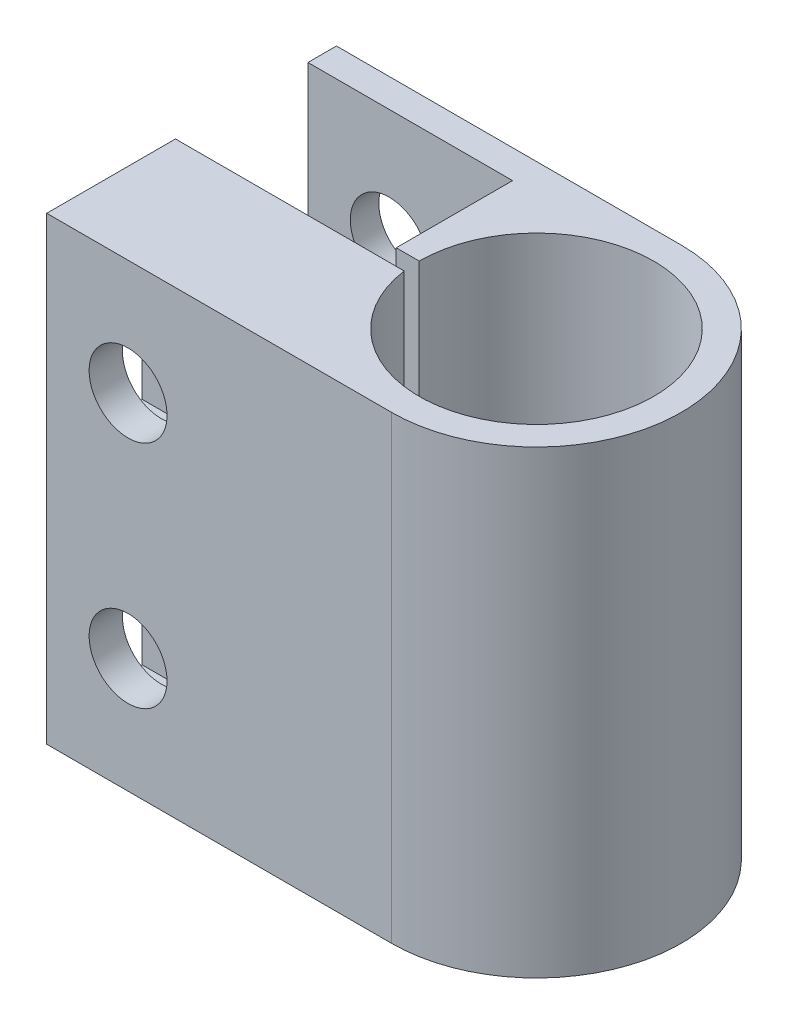
ISO-10303-21;
HEADER;
FILE_DESCRIPTION(('STEP AP214'),'2;1');
FILE_NAME('part.step','',(''),(''),'','','');
FILE_SCHEMA(('AUTOMOTIVE_DESIGN { 1 0 10303 214 1 1 1 1 }'));
ENDSEC;
DATA;
#1=APPLICATION_CONTEXT('core data for automotive mechanical design processes');
#2=APPLICATION_PROTOCOL_DEFINITION('international standard','automotive_design',2000,#1);
#3=PRODUCT_CONTEXT('',#1,'mechanical');
#4=PRODUCT('Part','Part','',(#3));
#5=PRODUCT_RELATED_PRODUCT_CATEGORY('part','',(#4));
#6=PRODUCT_DEFINITION_FORMATION('','',#4);
#7=PRODUCT_DEFINITION_CONTEXT('part definition',#1,'design');
#8=PRODUCT_DEFINITION('design','',#6,#7);
#9=PRODUCT_DEFINITION_SHAPE('','',#8);
#10=(LENGTH_UNIT() NAMED_UNIT(*) SI_UNIT(.MILLI.,.METRE.));
#11=(NAMED_UNIT(*) PLANE_ANGLE_UNIT() SI_UNIT($,.RADIAN.));
#12=(NAMED_UNIT(*) SI_UNIT($,.STERADIAN.) SOLID_ANGLE_UNIT());
#13=UNCERTAINTY_MEASURE_WITH_UNIT(LENGTH_MEASURE(1.E-05),#10,'distance_accuracy_value','');
#14=(GEOMETRIC_REPRESENTATION_CONTEXT(3) GLOBAL_UNCERTAINTY_ASSIGNED_CONTEXT((#13)) GLOBAL_UNIT_ASSIGNED_CONTEXT((#10,
#11,#12)) REPRESENTATION_CONTEXT('',''));
#15=CARTESIAN_POINT('',(0.,0.,0.));
#16=DIRECTION('',(0.,0.,1.));
#17=DIRECTION('',(1.,0.,0.));
#18=AXIS2_PLACEMENT_3D('',#15,#16,#17);
#19=CARTESIAN_POINT('',(26.9738126204793,25.4,-45.1348126204768));
#20=DIRECTION('',(1.,0.,0.));
#21=DIRECTION('',(0.,0.,-1.));
#22=AXIS2_PLACEMENT_3D('',#19,#20,#21);
#23=PLANE('',#22);
#24=DIRECTION('',(0.,0.,1.));
#25=VECTOR('',#24,1.);
#26=CARTESIAN_POINT('',(26.9738126204793,0.,-45.1348126204768));
#27=LINE('',#26,#25);
#28=CARTESIAN_POINT('',(26.9738126204793,0.,-45.1348126204768));
#29=VERTEX_POINT('',#28);
#30=CARTESIAN_POINT('',(26.9738126204793,0.,-38.0228126204795));
#31=VERTEX_POINT('',#30);
#32=EDGE_CURVE('E93',#29,#31,#27,.T.);
#33=ORIENTED_EDGE('',*,*,#32,.T.);
#34=DIRECTION('',(0.,-1.,0.));
#35=VECTOR('',#34,1.);
#36=CARTESIAN_POINT('',(26.9738126204793,25.4,-38.0228126204795));
#37=LINE('',#36,#35);
#38=CARTESIAN_POINT('',(26.9738126204793,25.4,-38.0228126204795));
#39=VERTEX_POINT('',#38);
#40=EDGE_CURVE('E145',#39,#31,#37,.T.);
#41=ORIENTED_EDGE('',*,*,#40,.F.);
#42=DIRECTION('',(0.,0.,1.));
#43=VECTOR('',#42,1.);
#44=CARTESIAN_POINT('',(26.9738126204793,25.4,-45.1348126204768));
#45=LINE('',#44,#43);
#46=CARTESIAN_POINT('',(26.9738126204793,25.4,-45.1348126204768));
#47=VERTEX_POINT('',#46);
#48=EDGE_CURVE('E133',#47,#39,#45,.T.);
#49=ORIENTED_EDGE('',*,*,#48,.F.);
#50=DIRECTION('',(0.,-1.,0.));
#51=VECTOR('',#50,1.);
#52=CARTESIAN_POINT('',(26.9738126204793,25.4,-45.1348126204768));
#53=LINE('',#52,#51);
#54=EDGE_CURVE('E140',#47,#29,#53,.T.);
#55=ORIENTED_EDGE('',*,*,#54,.T.);
#56=EDGE_LOOP('',(#33,#41,#49,#55));
#57=FACE_BOUND('',#56,.T.);
#58=DIRECTION('',(0.,1.,0.));
#59=VECTOR('',#58,1.);
#60=CARTESIAN_POINT('',(26.9738126204793,16.456181746882,-39.8643126204781));
#61=LINE('',#60,#59);
#62=CARTESIAN_POINT('',(26.9738126204793,13.8623634937639,-39.8643126204781));
#63=VERTEX_POINT('',#62);
#64=CARTESIAN_POINT('',(26.9738126204793,24.2376365062361,-39.8643126204781));
#65=VERTEX_POINT('',#64);
#66=EDGE_CURVE('E602',#63,#65,#61,.T.);
#67=ORIENTED_EDGE('',*,*,#66,.F.);
#68=DIRECTION('',(0.,0.,1.));
#69=VECTOR('',#68,1.);
#70=CARTESIAN_POINT('',(26.9738126204793,13.8623634937639,-43.2933126204781));
#71=LINE('',#70,#69);
#72=CARTESIAN_POINT('',(26.9738126204793,13.8623634937639,-43.2933126204781));
#73=VERTEX_POINT('',#72);
#74=EDGE_CURVE('E613',#73,#63,#71,.T.);
#75=ORIENTED_EDGE('',*,*,#74,.F.);
#76=DIRECTION('',(0.,1.,0.));
#77=VECTOR('',#76,1.);
#78=CARTESIAN_POINT('',(26.9738126204793,16.456181746882,-43.2933126204781));
#79=LINE('',#78,#77);
#80=CARTESIAN_POINT('',(26.9738126204793,24.2376365062361,-43.2933126204781));
#81=VERTEX_POINT('',#80);
#82=EDGE_CURVE('E658',#73,#81,#79,.T.);
#83=ORIENTED_EDGE('',*,*,#82,.T.);
#84=DIRECTION('',(0.,0.,-1.));
#85=VECTOR('',#84,1.);
#86=CARTESIAN_POINT('',(26.9738126204793,24.2376365062361,-43.2933126204781));
#87=LINE('',#86,#85);
#88=EDGE_CURVE('E610',#65,#81,#87,.T.);
#89=ORIENTED_EDGE('',*,*,#88,.F.);
#90=EDGE_LOOP('',(#67,#75,#83,#89));
#91=FACE_BOUND('',#90,.T.);
#92=DIRECTION('',(0.,1.,0.));
#93=VECTOR('',#92,1.);
#94=CARTESIAN_POINT('',(26.9738126204793,8.94381825311804,-43.2933126204781));
#95=LINE('',#94,#93);
#96=CARTESIAN_POINT('',(26.9738126204793,1.16236349376393,-43.2933126204781));
#97=VERTEX_POINT('',#96);
#98=CARTESIAN_POINT('',(26.9738126204793,11.5376365062361,-43.2933126204781));
#99=VERTEX_POINT('',#98);
#100=EDGE_CURVE('E631',#97,#99,#95,.T.);
#101=ORIENTED_EDGE('',*,*,#100,.T.);
#102=DIRECTION('',(0.,0.,-1.));
#103=VECTOR('',#102,1.);
#104=CARTESIAN_POINT('',(26.9738126204793,11.5376365062361,-43.2933126204781));
#105=LINE('',#104,#103);
#106=CARTESIAN_POINT('',(26.9738126204793,11.5376365062361,-39.8643126204781));
#107=VERTEX_POINT('',#106);
#108=EDGE_CURVE('E592',#107,#99,#105,.T.);
#109=ORIENTED_EDGE('',*,*,#108,.F.);
#110=DIRECTION('',(0.,1.,0.));
#111=VECTOR('',#110,1.);
#112=CARTESIAN_POINT('',(26.9738126204793,8.94381825311804,-39.8643126204781));
#113=LINE('',#112,#111);
#114=CARTESIAN_POINT('',(26.9738126204793,1.16236349376393,-39.8643126204781));
#115=VERTEX_POINT('',#114);
#116=EDGE_CURVE('E643',#115,#107,#113,.T.);
#117=ORIENTED_EDGE('',*,*,#116,.F.);
#118=DIRECTION('',(0.,0.,1.));
#119=VECTOR('',#118,1.);
#120=CARTESIAN_POINT('',(26.9738126204793,1.16236349376393,-43.2933126204781));
#121=LINE('',#120,#119);
#122=EDGE_CURVE('E577',#97,#115,#121,.T.);
#123=ORIENTED_EDGE('',*,*,#122,.F.);
#124=EDGE_LOOP('',(#101,#109,#117,#123));
#125=FACE_BOUND('',#124,.T.);
#126=ADVANCED_FACE('F38',(#57,#91,#125),#23,.F.);
#127=CARTESIAN_POINT('',(31.4664376204793,19.05,-54.0248126204768));
#128=DIRECTION('',(0.,0.,1.));
#129=DIRECTION('',(1.,0.,0.));
#130=AXIS2_PLACEMENT_3D('',#127,#128,#129);
#131=CYLINDRICAL_SURFACE('',#130,2.15265);
#132=CARTESIAN_POINT('',(31.4664376204793,19.05,-38.0228126204795));
#133=DIRECTION('',(0.,0.,-1.));
#134=DIRECTION('',(-1.,0.,0.));
#135=AXIS2_PLACEMENT_3D('',#132,#133,#134);
#136=CIRCLE('',#135,2.15265);
#137=CARTESIAN_POINT('',(29.3137876204793,19.05,-38.0228126204795));
#138=VERTEX_POINT('',#137);
#139=EDGE_CURVE('E201',#138,#138,#136,.T.);
#140=ORIENTED_EDGE('',*,*,#139,.F.);
#141=EDGE_LOOP('',(#140));
#142=FACE_BOUND('',#141,.T.);
#143=CARTESIAN_POINT('',(31.4664376204793,19.05,-39.8643126204781));
#144=DIRECTION('',(0.,0.,-1.));
#145=DIRECTION('',(-1.,0.,0.));
#146=AXIS2_PLACEMENT_3D('',#143,#144,#145);
#147=CIRCLE('',#146,2.15265);
#148=CARTESIAN_POINT('',(29.3137876204793,19.05,-39.8643126204781));
#149=VERTEX_POINT('',#148);
#150=EDGE_CURVE('E196',#149,#149,#147,.T.);
#151=ORIENTED_EDGE('',*,*,#150,.T.);
#152=EDGE_LOOP('',(#151));
#153=FACE_BOUND('',#152,.T.);
#154=ADVANCED_FACE('F267',(#142,#153),#131,.F.);
#155=CARTESIAN_POINT('',(31.4664376204793,6.35,-54.0248126204768));
#156=DIRECTION('',(0.,0.,1.));
#157=DIRECTION('',(1.,0.,0.));
#158=AXIS2_PLACEMENT_3D('',#155,#156,#157);
#159=CYLINDRICAL_SURFACE('',#158,2.15265);
#160=CARTESIAN_POINT('',(31.4664376204793,6.35,-45.1348126204768));
#161=DIRECTION('',(0.,0.,1.));
#162=DIRECTION('',(1.,0.,0.));
#163=AXIS2_PLACEMENT_3D('',#160,#161,#162);
#164=CIRCLE('',#163,2.15265);
#165=CARTESIAN_POINT('',(33.6190876204793,6.35,-45.1348126204768));
#166=VERTEX_POINT('',#165);
#167=EDGE_CURVE('E221',#166,#166,#164,.F.);
#168=ORIENTED_EDGE('',*,*,#167,.T.);
#169=EDGE_LOOP('',(#168));
#170=FACE_BOUND('',#169,.T.);
#171=CARTESIAN_POINT('',(31.4664376204793,6.35,-43.2933126204781));
#172=DIRECTION('',(0.,0.,1.));
#173=DIRECTION('',(1.,0.,0.));
#174=AXIS2_PLACEMENT_3D('',#171,#172,#173);
#175=CIRCLE('',#174,2.15265);
#176=CARTESIAN_POINT('',(33.6190876204793,6.35,-43.2933126204781));
#177=VERTEX_POINT('',#176);
#178=EDGE_CURVE('E193',#177,#177,#175,.T.);
#179=ORIENTED_EDGE('',*,*,#178,.T.);
#180=EDGE_LOOP('',(#179));
#181=FACE_BOUND('',#180,.T.);
#182=ADVANCED_FACE('F271',(#170,#181),#159,.F.);
#183=CARTESIAN_POINT('',(46.0238126204793,25.4,-46.0238126204795));
#184=DIRECTION('',(0.,-1.,0.));
#185=DIRECTION('',(0.,0.,-1.));
#186=AXIS2_PLACEMENT_3D('',#183,#184,#185);
#187=CYLINDRICAL_SURFACE('',#186,8.00099999999726);
#188=CARTESIAN_POINT('',(46.0238126204793,0.,-46.0238126204795));
#189=DIRECTION('',(0.,1.,0.));
#190=DIRECTION('',(0.,0.,1.));
#191=AXIS2_PLACEMENT_3D('',#188,#189,#190);
#192=CIRCLE('',#191,8.00099999999726);
#193=CARTESIAN_POINT('',(46.0238126204793,0.,-38.0228126204795));
#194=VERTEX_POINT('',#193);
#195=CARTESIAN_POINT('',(46.0238126204793,0.,-54.024812620474));
#196=VERTEX_POINT('',#195);
#197=EDGE_CURVE('E153',#194,#196,#192,.T.);
#198=ORIENTED_EDGE('',*,*,#197,.T.);
#199=DIRECTION('',(0.,-1.,0.));
#200=VECTOR('',#199,1.);
#201=CARTESIAN_POINT('',(46.0238126204793,25.4,-54.024812620474));
#202=LINE('',#201,#200);
#203=CARTESIAN_POINT('',(46.0238126204793,25.4,-54.024812620474));
#204=VERTEX_POINT('',#203);
#205=EDGE_CURVE('E11',#204,#196,#202,.T.);
#206=ORIENTED_EDGE('',*,*,#205,.F.);
#207=CARTESIAN_POINT('',(46.0238126204793,25.4,-46.0238126204795));
#208=DIRECTION('',(0.,1.,0.));
#209=DIRECTION('',(0.,0.,1.));
#210=AXIS2_PLACEMENT_3D('',#207,#208,#209);
#211=CIRCLE('',#210,8.00099999999726);
#212=CARTESIAN_POINT('',(46.0238126204793,25.4,-38.0228126204795));
#213=VERTEX_POINT('',#212);
#214=EDGE_CURVE('E172',#213,#204,#211,.T.);
#215=ORIENTED_EDGE('',*,*,#214,.F.);
#216=DIRECTION('',(0.,-1.,0.));
#217=VECTOR('',#216,1.);
#218=CARTESIAN_POINT('',(46.0238126204793,25.4,-38.0228126204795));
#219=LINE('',#218,#217);
#220=EDGE_CURVE('E149',#213,#194,#219,.T.);
#221=ORIENTED_EDGE('',*,*,#220,.T.);
#222=EDGE_LOOP('',(#198,#206,#215,#221));
#223=FACE_BOUND('',#222,.T.);
#224=ADVANCED_FACE('F40',(#223),#187,.T.);
#225=CARTESIAN_POINT('',(46.0238126204793,25.4,-54.024812620474));
#226=DIRECTION('',(0.,0.,1.));
#227=DIRECTION('',(1.,0.,0.));
#228=AXIS2_PLACEMENT_3D('',#225,#226,#227);
#229=PLANE('',#228);
#230=CARTESIAN_POINT('',(31.4664376204793,6.35,-54.0248126204768));
#231=DIRECTION('',(0.,0.,-1.));
#232=DIRECTION('',(-1.,0.,0.));
#233=AXIS2_PLACEMENT_3D('',#230,#231,#232);
#234=CIRCLE('',#233,2.15265);
#235=CARTESIAN_POINT('',(29.3137876204793,6.35,-54.0248126204768));
#236=VERTEX_POINT('',#235);
#237=EDGE_CURVE('E218',#236,#236,#234,.T.);
#238=ORIENTED_EDGE('',*,*,#237,.F.);
#239=EDGE_LOOP('',(#238));
#240=FACE_BOUND('',#239,.T.);
#241=CARTESIAN_POINT('',(31.4664376204793,19.05,-54.0248126204768));
#242=DIRECTION('',(0.,0.,-1.));
#243=DIRECTION('',(-1.,0.,0.));
#244=AXIS2_PLACEMENT_3D('',#241,#242,#243);
#245=CIRCLE('',#244,2.15265);
#246=CARTESIAN_POINT('',(29.3137876204793,19.05,-54.0248126204768));
#247=VERTEX_POINT('',#246);
#248=EDGE_CURVE('E205',#247,#247,#245,.T.);
#249=ORIENTED_EDGE('',*,*,#248,.F.);
#250=EDGE_LOOP('',(#249));
#251=FACE_BOUND('',#250,.T.);
#252=DIRECTION('',(-1.,0.,0.));
#253=VECTOR('',#252,1.);
#254=CARTESIAN_POINT('',(46.0238126204793,0.,-54.024812620474));
#255=LINE('',#254,#253);
#256=CARTESIAN_POINT('',(26.9738126204793,0.,-54.024812620474));
#257=VERTEX_POINT('',#256);
#258=EDGE_CURVE('E156',#196,#257,#255,.T.);
#259=ORIENTED_EDGE('',*,*,#258,.T.);
#260=DIRECTION('',(0.,-1.,0.));
#261=VECTOR('',#260,1.);
#262=CARTESIAN_POINT('',(26.9738126204793,25.4,-54.024812620474));
#263=LINE('',#262,#261);
#264=CARTESIAN_POINT('',(26.9738126204793,25.4,-54.024812620474));
#265=VERTEX_POINT('',#264);
#266=EDGE_CURVE('E48',#265,#257,#263,.T.);
#267=ORIENTED_EDGE('',*,*,#266,.F.);
#268=DIRECTION('',(-1.,0.,0.));
#269=VECTOR('',#268,1.);
#270=CARTESIAN_POINT('',(46.0238126204793,25.4,-54.024812620474));
#271=LINE('',#270,#269);
#272=EDGE_CURVE('E107',#204,#265,#271,.T.);
#273=ORIENTED_EDGE('',*,*,#272,.F.);
#274=ORIENTED_EDGE('',*,*,#205,.T.);
#275=EDGE_LOOP('',(#259,#267,#273,#274));
#276=FACE_BOUND('',#275,.T.);
#277=ADVANCED_FACE('F291',(#240,#251,#276),#229,.F.);
#278=CARTESIAN_POINT('',(26.9738126204793,25.4,-54.024812620474));
#279=DIRECTION('',(1.,0.,0.));
#280=DIRECTION('',(0.,0.,-1.));
#281=AXIS2_PLACEMENT_3D('',#278,#279,#280);
#282=PLANE('',#281);
#283=DIRECTION('',(0.,0.,1.));
#284=VECTOR('',#283,1.);
#285=CARTESIAN_POINT('',(26.9738126204793,0.,-54.024812620474));
#286=LINE('',#285,#284);
#287=CARTESIAN_POINT('',(26.9738126204793,0.,-52.4500126204768));
#288=VERTEX_POINT('',#287);
#289=EDGE_CURVE('E159',#257,#288,#286,.T.);
#290=ORIENTED_EDGE('',*,*,#289,.T.);
#291=DIRECTION('',(0.,-1.,0.));
#292=VECTOR('',#291,1.);
#293=CARTESIAN_POINT('',(26.9738126204793,25.4,-52.4500126204768));
#294=LINE('',#293,#292);
#295=CARTESIAN_POINT('',(26.9738126204793,25.4,-52.4500126204768));
#296=VERTEX_POINT('',#295);
#297=EDGE_CURVE('E185',#296,#288,#294,.T.);
#298=ORIENTED_EDGE('',*,*,#297,.F.);
#299=DIRECTION('',(0.,0.,1.));
#300=VECTOR('',#299,1.);
#301=CARTESIAN_POINT('',(26.9738126204793,25.4,-54.024812620474));
#302=LINE('',#301,#300);
#303=EDGE_CURVE('E228',#265,#296,#302,.T.);
#304=ORIENTED_EDGE('',*,*,#303,.F.);
#305=ORIENTED_EDGE('',*,*,#266,.T.);
#306=EDGE_LOOP('',(#290,#298,#304,#305));
#307=FACE_BOUND('',#306,.T.);
#308=ADVANCED_FACE('F288',(#307),#282,.F.);
#309=CARTESIAN_POINT('',(26.9738126204793,25.4,-52.4500126204768));
#310=DIRECTION('',(0.,0.,-1.));
#311=DIRECTION('',(-1.,0.,0.));
#312=AXIS2_PLACEMENT_3D('',#309,#310,#311);
#313=PLANE('',#312);
#314=CARTESIAN_POINT('',(31.4664376204793,6.35,-52.4500126204768));
#315=DIRECTION('',(0.,0.,-1.));
#316=DIRECTION('',(-1.,0.,0.));
#317=AXIS2_PLACEMENT_3D('',#314,#315,#316);
#318=CIRCLE('',#317,2.15265);
#319=CARTESIAN_POINT('',(29.3137876204793,6.35,-52.4500126204768));
#320=VERTEX_POINT('',#319);
#321=EDGE_CURVE('E157',#320,#320,#318,.F.);
#322=ORIENTED_EDGE('',*,*,#321,.F.);
#323=EDGE_LOOP('',(#322));
#324=FACE_BOUND('',#323,.T.);
#325=CARTESIAN_POINT('',(31.4664376204793,19.05,-52.4500126204768));
#326=DIRECTION('',(0.,0.,-1.));
#327=DIRECTION('',(-1.,0.,0.));
#328=AXIS2_PLACEMENT_3D('',#325,#326,#327);
#329=CIRCLE('',#328,2.15265);
#330=CARTESIAN_POINT('',(29.3137876204793,19.05,-52.4500126204768));
#331=VERTEX_POINT('',#330);
#332=EDGE_CURVE('E217',#331,#331,#329,.F.);
#333=ORIENTED_EDGE('',*,*,#332,.F.);
#334=EDGE_LOOP('',(#333));
#335=FACE_BOUND('',#334,.T.);
#336=DIRECTION('',(1.,0.,0.));
#337=VECTOR('',#336,1.);
#338=CARTESIAN_POINT('',(26.9738126204793,0.,-52.4500126204768));
#339=LINE('',#338,#337);
#340=CARTESIAN_POINT('',(38.2768126204793,0.,-52.4500126204768));
#341=VERTEX_POINT('',#340);
#342=EDGE_CURVE('E161',#288,#341,#339,.T.);
#343=ORIENTED_EDGE('',*,*,#342,.T.);
#344=DIRECTION('',(0.,-1.,0.));
#345=VECTOR('',#344,1.);
#346=CARTESIAN_POINT('',(38.2768126204793,25.4,-52.4500126204768));
#347=LINE('',#346,#345);
#348=CARTESIAN_POINT('',(38.2768126204793,25.4,-52.4500126204768));
#349=VERTEX_POINT('',#348);
#350=EDGE_CURVE('E182',#349,#341,#347,.T.);
#351=ORIENTED_EDGE('',*,*,#350,.F.);
#352=DIRECTION('',(1.,0.,0.));
#353=VECTOR('',#352,1.);
#354=CARTESIAN_POINT('',(26.9738126204793,25.4,-52.4500126204768));
#355=LINE('',#354,#353);
#356=EDGE_CURVE('E230',#296,#349,#355,.T.);
#357=ORIENTED_EDGE('',*,*,#356,.F.);
#358=ORIENTED_EDGE('',*,*,#297,.T.);
#359=EDGE_LOOP('',(#343,#351,#357,#358));
#360=FACE_BOUND('',#359,.T.);
#361=ADVANCED_FACE('F284',(#324,#335,#360),#313,.F.);
#362=CARTESIAN_POINT('',(38.2768126204793,25.4,-52.4500126204768));
#363=DIRECTION('',(1.,0.,0.));
#364=DIRECTION('',(0.,0.,-1.));
#365=AXIS2_PLACEMENT_3D('',#362,#363,#364);
#366=PLANE('',#365);
#367=DIRECTION('',(0.,0.,1.));
#368=VECTOR('',#367,1.);
#369=CARTESIAN_POINT('',(38.2768126204793,0.,-52.4500126204768));
#370=LINE('',#369,#368);
#371=CARTESIAN_POINT('',(38.2768126204793,0.,-46.0238126204768));
#372=VERTEX_POINT('',#371);
#373=EDGE_CURVE('E163',#341,#372,#370,.T.);
#374=ORIENTED_EDGE('',*,*,#373,.T.);
#375=DIRECTION('',(0.,-1.,0.));
#376=VECTOR('',#375,1.);
#377=CARTESIAN_POINT('',(38.2768126204793,25.4,-46.0238126204768));
#378=LINE('',#377,#376);
#379=CARTESIAN_POINT('',(38.2768126204793,25.4,-46.0238126204768));
#380=VERTEX_POINT('',#379);
#381=EDGE_CURVE('E179',#380,#372,#378,.T.);
#382=ORIENTED_EDGE('',*,*,#381,.F.);
#383=DIRECTION('',(0.,0.,1.));
#384=VECTOR('',#383,1.);
#385=CARTESIAN_POINT('',(38.2768126204793,25.4,-52.4500126204768));
#386=LINE('',#385,#384);
#387=EDGE_CURVE('E232',#349,#380,#386,.T.);
#388=ORIENTED_EDGE('',*,*,#387,.F.);
#389=ORIENTED_EDGE('',*,*,#350,.T.);
#390=EDGE_LOOP('',(#374,#382,#388,#389));
#391=FACE_BOUND('',#390,.T.);
#392=ADVANCED_FACE('F281',(#391),#366,.F.);
#393=CARTESIAN_POINT('',(38.2768126204793,25.4,-46.0238126204768));
#394=DIRECTION('',(0.,0.,-1.));
#395=DIRECTION('',(-1.,0.,0.));
#396=AXIS2_PLACEMENT_3D('',#393,#394,#395);
#397=PLANE('',#396);
#398=DIRECTION('',(1.,0.,0.));
#399=VECTOR('',#398,1.);
#400=CARTESIAN_POINT('',(38.2768126204793,0.,-46.0238126204768));
#401=LINE('',#400,#399);
#402=CARTESIAN_POINT('',(39.5468126204793,0.,-46.0238126204768));
#403=VERTEX_POINT('',#402);
#404=EDGE_CURVE('E165',#372,#403,#401,.T.);
#405=ORIENTED_EDGE('',*,*,#404,.T.);
#406=DIRECTION('',(0.,-1.,0.));
#407=VECTOR('',#406,1.);
#408=CARTESIAN_POINT('',(39.5468126204793,25.4,-46.0238126204768));
#409=LINE('',#408,#407);
#410=CARTESIAN_POINT('',(39.5468126204793,25.4,-46.0238126204768));
#411=VERTEX_POINT('',#410);
#412=EDGE_CURVE('E176',#411,#403,#409,.T.);
#413=ORIENTED_EDGE('',*,*,#412,.F.);
#414=DIRECTION('',(1.,0.,0.));
#415=VECTOR('',#414,1.);
#416=CARTESIAN_POINT('',(38.2768126204793,25.4,-46.0238126204768));
#417=LINE('',#416,#415);
#418=EDGE_CURVE('E234',#380,#411,#417,.T.);
#419=ORIENTED_EDGE('',*,*,#418,.F.);
#420=ORIENTED_EDGE('',*,*,#381,.T.);
#421=EDGE_LOOP('',(#405,#413,#419,#420));
#422=FACE_BOUND('',#421,.T.);
#423=ADVANCED_FACE('F240',(#422),#397,.F.);
#424=CARTESIAN_POINT('',(46.0238126204793,25.4,-46.0238126204795));
#425=DIRECTION('',(0.,-1.,0.));
#426=DIRECTION('',(0.,0.,-1.));
#427=AXIS2_PLACEMENT_3D('',#424,#425,#426);
#428=CYLINDRICAL_SURFACE('',#427,6.477);
#429=CARTESIAN_POINT('',(46.0238126204793,0.,-46.0238126204795));
#430=DIRECTION('',(0.,-1.,0.));
#431=DIRECTION('',(0.,0.,1.));
#432=AXIS2_PLACEMENT_3D('',#429,#430,#431);
#433=CIRCLE('',#432,6.477);
#434=CARTESIAN_POINT('',(39.6081125027996,0.,-45.1348126204768));
#435=VERTEX_POINT('',#434);
#436=EDGE_CURVE('E167',#403,#435,#433,.T.);
#437=ORIENTED_EDGE('',*,*,#436,.T.);
#438=DIRECTION('',(0.,-1.,0.));
#439=VECTOR('',#438,1.);
#440=CARTESIAN_POINT('',(39.6081125027996,25.4,-45.1348126204768));
#441=LINE('',#440,#439);
#442=CARTESIAN_POINT('',(39.6081125027996,25.4,-45.1348126204768));
#443=VERTEX_POINT('',#442);
#444=EDGE_CURVE('E144',#443,#435,#441,.T.);
#445=ORIENTED_EDGE('',*,*,#444,.F.);
#446=CARTESIAN_POINT('',(46.0238126204793,25.4,-46.0238126204795));
#447=DIRECTION('',(0.,-1.,0.));
#448=DIRECTION('',(0.,0.,1.));
#449=AXIS2_PLACEMENT_3D('',#446,#447,#448);
#450=CIRCLE('',#449,6.477);
#451=EDGE_CURVE('E135',#411,#443,#450,.T.);
#452=ORIENTED_EDGE('',*,*,#451,.F.);
#453=ORIENTED_EDGE('',*,*,#412,.T.);
#454=EDGE_LOOP('',(#437,#445,#452,#453));
#455=FACE_BOUND('',#454,.T.);
#456=ADVANCED_FACE('F244',(#455),#428,.F.);
#457=CARTESIAN_POINT('',(39.6081125027996,25.4,-45.1348126204768));
#458=DIRECTION('',(0.,0.,1.));
#459=DIRECTION('',(1.,0.,0.));
#460=AXIS2_PLACEMENT_3D('',#457,#458,#459);
#461=PLANE('',#460);
#462=ORIENTED_EDGE('',*,*,#167,.F.);
#463=EDGE_LOOP('',(#462));
#464=FACE_BOUND('',#463,.T.);
#465=CARTESIAN_POINT('',(31.4664376204793,19.05,-45.1348126204768));
#466=DIRECTION('',(0.,0.,1.));
#467=DIRECTION('',(1.,0.,0.));
#468=AXIS2_PLACEMENT_3D('',#465,#466,#467);
#469=CIRCLE('',#468,2.15265);
#470=CARTESIAN_POINT('',(33.6190876204793,19.05,-45.1348126204768));
#471=VERTEX_POINT('',#470);
#472=EDGE_CURVE('E214',#471,#471,#469,.F.);
#473=ORIENTED_EDGE('',*,*,#472,.F.);
#474=EDGE_LOOP('',(#473));
#475=FACE_BOUND('',#474,.T.);
#476=DIRECTION('',(-1.,0.,0.));
#477=VECTOR('',#476,1.);
#478=CARTESIAN_POINT('',(39.6081125027996,0.,-45.1348126204768));
#479=LINE('',#478,#477);
#480=EDGE_CURVE('E143',#435,#29,#479,.T.);
#481=ORIENTED_EDGE('',*,*,#480,.T.);
#482=ORIENTED_EDGE('',*,*,#54,.F.);
#483=DIRECTION('',(-1.,0.,0.));
#484=VECTOR('',#483,1.);
#485=CARTESIAN_POINT('',(39.6081125027996,25.4,-45.1348126204768));
#486=LINE('',#485,#484);
#487=EDGE_CURVE('E129',#443,#47,#486,.T.);
#488=ORIENTED_EDGE('',*,*,#487,.F.);
#489=ORIENTED_EDGE('',*,*,#444,.T.);
#490=EDGE_LOOP('',(#481,#482,#488,#489));
#491=FACE_BOUND('',#490,.T.);
#492=ADVANCED_FACE('F141',(#464,#475,#491),#461,.F.);
#493=CARTESIAN_POINT('',(26.9738126204793,25.4,-38.0228126204795));
#494=DIRECTION('',(0.,0.,-1.));
#495=DIRECTION('',(-1.,0.,0.));
#496=AXIS2_PLACEMENT_3D('',#493,#494,#495);
#497=PLANE('',#496);
#498=CARTESIAN_POINT('',(31.4664376204793,6.35,-38.0228126204795));
#499=DIRECTION('',(0.,0.,-1.));
#500=DIRECTION('',(-1.,0.,0.));
#501=AXIS2_PLACEMENT_3D('',#498,#499,#500);
#502=CIRCLE('',#501,2.15265);
#503=CARTESIAN_POINT('',(29.3137876204793,6.35,-38.0228126204795));
#504=VERTEX_POINT('',#503);
#505=EDGE_CURVE('E210',#504,#504,#502,.T.);
#506=ORIENTED_EDGE('',*,*,#505,.T.);
#507=EDGE_LOOP('',(#506));
#508=FACE_BOUND('',#507,.T.);
#509=ORIENTED_EDGE('',*,*,#139,.T.);
#510=EDGE_LOOP('',(#509));
#511=FACE_BOUND('',#510,.T.);
#512=DIRECTION('',(1.,0.,0.));
#513=VECTOR('',#512,1.);
#514=CARTESIAN_POINT('',(26.9738126204793,0.,-38.0228126204795));
#515=LINE('',#514,#513);
#516=EDGE_CURVE('E99',#31,#194,#515,.T.);
#517=ORIENTED_EDGE('',*,*,#516,.T.);
#518=ORIENTED_EDGE('',*,*,#220,.F.);
#519=DIRECTION('',(1.,0.,0.));
#520=VECTOR('',#519,1.);
#521=CARTESIAN_POINT('',(26.9738126204793,25.4,-38.0228126204795));
#522=LINE('',#521,#520);
#523=EDGE_CURVE('E57',#39,#213,#522,.T.);
#524=ORIENTED_EDGE('',*,*,#523,.F.);
#525=ORIENTED_EDGE('',*,*,#40,.T.);
#526=EDGE_LOOP('',(#517,#518,#524,#525));
#527=FACE_BOUND('',#526,.T.);
#528=ADVANCED_FACE('F252',(#508,#511,#527),#497,.F.);
#529=CARTESIAN_POINT('',(46.0238126204793,25.4,-46.0238126204795));
#530=DIRECTION('',(0.,1.,0.));
#531=DIRECTION('',(0.,0.,1.));
#532=AXIS2_PLACEMENT_3D('',#529,#530,#531);
#533=PLANE('',#532);
#534=ORIENTED_EDGE('',*,*,#214,.T.);
#535=ORIENTED_EDGE('',*,*,#272,.T.);
#536=ORIENTED_EDGE('',*,*,#303,.T.);
#537=ORIENTED_EDGE('',*,*,#356,.T.);
#538=ORIENTED_EDGE('',*,*,#387,.T.);
#539=ORIENTED_EDGE('',*,*,#418,.T.);
#540=ORIENTED_EDGE('',*,*,#451,.T.);
#541=ORIENTED_EDGE('',*,*,#487,.T.);
#542=ORIENTED_EDGE('',*,*,#48,.T.);
#543=ORIENTED_EDGE('',*,*,#523,.T.);
#544=EDGE_LOOP('',(#534,#535,#536,#537,#538,#539,#540,#541,#542,#543));
#545=FACE_BOUND('',#544,.T.);
#546=ADVANCED_FACE('F131',(#545),#533,.T.);
#547=CARTESIAN_POINT('',(46.0238126204793,0.,-46.0238126204795));
#548=DIRECTION('',(0.,1.,0.));
#549=DIRECTION('',(0.,0.,1.));
#550=AXIS2_PLACEMENT_3D('',#547,#548,#549);
#551=PLANE('',#550);
#552=ORIENTED_EDGE('',*,*,#197,.F.);
#553=ORIENTED_EDGE('',*,*,#516,.F.);
#554=ORIENTED_EDGE('',*,*,#32,.F.);
#555=ORIENTED_EDGE('',*,*,#480,.F.);
#556=ORIENTED_EDGE('',*,*,#436,.F.);
#557=ORIENTED_EDGE('',*,*,#404,.F.);
#558=ORIENTED_EDGE('',*,*,#373,.F.);
#559=ORIENTED_EDGE('',*,*,#342,.F.);
#560=ORIENTED_EDGE('',*,*,#289,.F.);
#561=ORIENTED_EDGE('',*,*,#258,.F.);
#562=EDGE_LOOP('',(#552,#553,#554,#555,#556,#557,#558,#559,#560,#561));
#563=FACE_BOUND('',#562,.T.);
#564=ADVANCED_FACE('F247',(#563),#551,.F.);
#565=CARTESIAN_POINT('',(31.4664376204793,19.05,-43.2933126204781));
#566=DIRECTION('',(0.,0.,-1.));
#567=DIRECTION('',(-1.,0.,0.));
#568=AXIS2_PLACEMENT_3D('',#565,#566,#567);
#569=CIRCLE('',#568,2.15265);
#570=CARTESIAN_POINT('',(29.3137876204793,19.05,-43.2933126204781));
#571=VERTEX_POINT('',#570);
#572=EDGE_CURVE('E42',#571,#571,#569,.T.);
#573=ORIENTED_EDGE('',*,*,#572,.F.);
#574=EDGE_LOOP('',(#573));
#575=FACE_BOUND('',#574,.T.);
#576=ORIENTED_EDGE('',*,*,#472,.T.);
#577=EDGE_LOOP('',(#576));
#578=FACE_BOUND('',#577,.T.);
#579=ADVANCED_FACE('F274',(#575,#578),#131,.F.);
#580=CARTESIAN_POINT('',(31.4664376204793,6.35,-39.8643126204781));
#581=DIRECTION('',(0.,0.,1.));
#582=DIRECTION('',(1.,0.,0.));
#583=AXIS2_PLACEMENT_3D('',#580,#581,#582);
#584=CIRCLE('',#583,2.15265);
#585=CARTESIAN_POINT('',(33.6190876204793,6.35,-39.8643126204781));
#586=VERTEX_POINT('',#585);
#587=EDGE_CURVE('E190',#586,#586,#584,.T.);
#588=ORIENTED_EDGE('',*,*,#587,.F.);
#589=EDGE_LOOP('',(#588));
#590=FACE_BOUND('',#589,.T.);
#591=ORIENTED_EDGE('',*,*,#505,.F.);
#592=EDGE_LOOP('',(#591));
#593=FACE_BOUND('',#592,.T.);
#594=ADVANCED_FACE('F313',(#590,#593),#159,.F.);
#595=ORIENTED_EDGE('',*,*,#248,.T.);
#596=EDGE_LOOP('',(#595));
#597=FACE_BOUND('',#596,.T.);
#598=ORIENTED_EDGE('',*,*,#332,.T.);
#599=EDGE_LOOP('',(#598));
#600=FACE_BOUND('',#599,.T.);
#601=ADVANCED_FACE('F275',(#597,#600),#131,.F.);
#602=ORIENTED_EDGE('',*,*,#237,.T.);
#603=EDGE_LOOP('',(#602));
#604=FACE_BOUND('',#603,.T.);
#605=ORIENTED_EDGE('',*,*,#321,.T.);
#606=EDGE_LOOP('',(#605));
#607=FACE_BOUND('',#606,.T.);
#608=ADVANCED_FACE('F312',(#604,#607),#159,.F.);
#609=CARTESIAN_POINT('',(35.9590626204793,3.75618174688197,-43.2933126204781));
#610=DIRECTION('',(-1.,0.,0.));
#611=DIRECTION('',(0.,-1.,0.));
#612=AXIS2_PLACEMENT_3D('',#609,#610,#611);
#613=PLANE('',#612);
#614=DIRECTION('',(0.,-1.,0.));
#615=VECTOR('',#614,1.);
#616=CARTESIAN_POINT('',(35.9590626204793,3.75618174688197,-39.8643126204781));
#617=LINE('',#616,#615);
#618=CARTESIAN_POINT('',(35.9590626204793,8.94381825311805,-39.8643126204781));
#619=VERTEX_POINT('',#618);
#620=CARTESIAN_POINT('',(35.9590626204793,3.75618174688197,-39.8643126204781));
#621=VERTEX_POINT('',#620);
#622=EDGE_CURVE('E637',#619,#621,#617,.T.);
#623=ORIENTED_EDGE('',*,*,#622,.F.);
#624=DIRECTION('',(0.,0.,1.));
#625=VECTOR('',#624,1.);
#626=CARTESIAN_POINT('',(35.9590626204793,8.94381825311805,-43.2933126204781));
#627=LINE('',#626,#625);
#628=CARTESIAN_POINT('',(35.9590626204793,8.94381825311805,-43.2933126204781));
#629=VERTEX_POINT('',#628);
#630=EDGE_CURVE('E636',#629,#619,#627,.T.);
#631=ORIENTED_EDGE('',*,*,#630,.F.);
#632=DIRECTION('',(0.,-1.,0.));
#633=VECTOR('',#632,1.);
#634=CARTESIAN_POINT('',(35.9590626204793,3.75618174688197,-43.2933126204781));
#635=LINE('',#634,#633);
#636=CARTESIAN_POINT('',(35.9590626204793,3.75618174688197,-43.2933126204781));
#637=VERTEX_POINT('',#636);
#638=EDGE_CURVE('E624',#629,#637,#635,.T.);
#639=ORIENTED_EDGE('',*,*,#638,.T.);
#640=DIRECTION('',(0.,0.,1.));
#641=VECTOR('',#640,1.);
#642=CARTESIAN_POINT('',(35.9590626204793,3.75618174688197,-43.2933126204781));
#643=LINE('',#642,#641);
#644=EDGE_CURVE('E194',#637,#621,#643,.T.);
#645=ORIENTED_EDGE('',*,*,#644,.T.);
#646=EDGE_LOOP('',(#623,#631,#639,#645));
#647=FACE_BOUND('',#646,.T.);
#648=ADVANCED_FACE('F320',(#647),#613,.T.);
#649=CARTESIAN_POINT('',(31.4664376204793,1.16236349376393,-43.2933126204781));
#650=DIRECTION('',(-0.5,0.866025403784439,0.));
#651=DIRECTION('',(-0.866025403784438,-0.5,0.));
#652=AXIS2_PLACEMENT_3D('',#649,#650,#651);
#653=PLANE('',#652);
#654=DIRECTION('',(-0.866025403784438,-0.5,0.));
#655=VECTOR('',#654,1.);
#656=CARTESIAN_POINT('',(31.4664376204793,1.16236349376393,-39.8643126204781));
#657=LINE('',#656,#655);
#658=CARTESIAN_POINT('',(31.4664376204793,1.16236349376393,-39.8643126204781));
#659=VERTEX_POINT('',#658);
#660=EDGE_CURVE('E640',#621,#659,#657,.T.);
#661=ORIENTED_EDGE('',*,*,#660,.F.);
#662=ORIENTED_EDGE('',*,*,#644,.F.);
#663=DIRECTION('',(-0.866025403784438,-0.5,0.));
#664=VECTOR('',#663,1.);
#665=CARTESIAN_POINT('',(31.4664376204793,1.16236349376393,-43.2933126204781));
#666=LINE('',#665,#664);
#667=CARTESIAN_POINT('',(31.4664376204793,1.16236349376393,-43.2933126204781));
#668=VERTEX_POINT('',#667);
#669=EDGE_CURVE('E627',#637,#668,#666,.T.);
#670=ORIENTED_EDGE('',*,*,#669,.T.);
#671=DIRECTION('',(0.,0.,1.));
#672=VECTOR('',#671,1.);
#673=CARTESIAN_POINT('',(31.4664376204793,1.16236349376393,-43.2933126204781));
#674=LINE('',#673,#672);
#675=EDGE_CURVE('E653',#668,#659,#674,.T.);
#676=ORIENTED_EDGE('',*,*,#675,.T.);
#677=EDGE_LOOP('',(#661,#662,#670,#676));
#678=FACE_BOUND('',#677,.T.);
#679=ADVANCED_FACE('F413',(#678),#653,.T.);
#680=CARTESIAN_POINT('',(35.9590626204793,8.94381825311805,-43.2933126204781));
#681=DIRECTION('',(-0.499999999999999,-0.86602540378444,0.));
#682=DIRECTION('',(0.866025403784439,-0.499999999999999,0.));
#683=AXIS2_PLACEMENT_3D('',#680,#681,#682);
#684=PLANE('',#683);
#685=DIRECTION('',(0.866025403784439,-0.499999999999999,0.));
#686=VECTOR('',#685,1.);
#687=CARTESIAN_POINT('',(35.9590626204793,8.94381825311805,-39.8643126204781));
#688=LINE('',#687,#686);
#689=CARTESIAN_POINT('',(31.4664376204793,11.5376365062361,-39.8643126204781));
#690=VERTEX_POINT('',#689);
#691=EDGE_CURVE('E628',#690,#619,#688,.T.);
#692=ORIENTED_EDGE('',*,*,#691,.F.);
#693=DIRECTION('',(0.,0.,1.));
#694=VECTOR('',#693,1.);
#695=CARTESIAN_POINT('',(31.4664376204793,11.5376365062361,-43.2933126204781));
#696=LINE('',#695,#694);
#697=CARTESIAN_POINT('',(31.4664376204793,11.5376365062361,-43.2933126204781));
#698=VERTEX_POINT('',#697);
#699=EDGE_CURVE('E650',#698,#690,#696,.T.);
#700=ORIENTED_EDGE('',*,*,#699,.F.);
#701=DIRECTION('',(0.866025403784439,-0.499999999999999,0.));
#702=VECTOR('',#701,1.);
#703=CARTESIAN_POINT('',(35.9590626204793,8.94381825311805,-43.2933126204781));
#704=LINE('',#703,#702);
#705=EDGE_CURVE('E633',#698,#629,#704,.T.);
#706=ORIENTED_EDGE('',*,*,#705,.T.);
#707=ORIENTED_EDGE('',*,*,#630,.T.);
#708=EDGE_LOOP('',(#692,#700,#706,#707));
#709=FACE_BOUND('',#708,.T.);
#710=ADVANCED_FACE('F461',(#709),#684,.T.);
#711=CARTESIAN_POINT('',(0.,0.,-43.2933126204781));
#712=DIRECTION('',(0.,0.,1.));
#713=DIRECTION('',(1.,0.,0.));
#714=AXIS2_PLACEMENT_3D('',#711,#712,#713);
#715=PLANE('',#714);
#716=ORIENTED_EDGE('',*,*,#178,.F.);
#717=EDGE_LOOP('',(#716));
#718=FACE_BOUND('',#717,.T.);
#719=ORIENTED_EDGE('',*,*,#705,.F.);
#720=DIRECTION('',(-1.,0.,0.));
#721=VECTOR('',#720,1.);
#722=CARTESIAN_POINT('',(31.4664376204793,11.5376365062361,-43.2933126204781));
#723=LINE('',#722,#721);
#724=EDGE_CURVE('E603',#698,#99,#723,.T.);
#725=ORIENTED_EDGE('',*,*,#724,.T.);
#726=ORIENTED_EDGE('',*,*,#100,.F.);
#727=DIRECTION('',(-1.,0.,0.));
#728=VECTOR('',#727,1.);
#729=CARTESIAN_POINT('',(31.4664376204793,1.16236349376393,-43.2933126204781));
#730=LINE('',#729,#728);
#731=EDGE_CURVE('E585',#668,#97,#730,.T.);
#732=ORIENTED_EDGE('',*,*,#731,.F.);
#733=ORIENTED_EDGE('',*,*,#669,.F.);
#734=ORIENTED_EDGE('',*,*,#638,.F.);
#735=EDGE_LOOP('',(#719,#725,#726,#732,#733,#734));
#736=FACE_BOUND('',#735,.T.);
#737=ADVANCED_FACE('F471',(#718,#736),#715,.T.);
#738=CARTESIAN_POINT('',(0.,0.,-39.8643126204781));
#739=DIRECTION('',(0.,0.,1.));
#740=DIRECTION('',(1.,0.,0.));
#741=AXIS2_PLACEMENT_3D('',#738,#739,#740);
#742=PLANE('',#741);
#743=ORIENTED_EDGE('',*,*,#587,.T.);
#744=EDGE_LOOP('',(#743));
#745=FACE_BOUND('',#744,.T.);
#746=ORIENTED_EDGE('',*,*,#116,.T.);
#747=DIRECTION('',(-1.,0.,0.));
#748=VECTOR('',#747,1.);
#749=CARTESIAN_POINT('',(31.4664376204793,11.5376365062361,-39.8643126204781));
#750=LINE('',#749,#748);
#751=EDGE_CURVE('E606',#690,#107,#750,.T.);
#752=ORIENTED_EDGE('',*,*,#751,.F.);
#753=ORIENTED_EDGE('',*,*,#691,.T.);
#754=ORIENTED_EDGE('',*,*,#622,.T.);
#755=ORIENTED_EDGE('',*,*,#660,.T.);
#756=DIRECTION('',(-1.,0.,0.));
#757=VECTOR('',#756,1.);
#758=CARTESIAN_POINT('',(31.4664376204793,1.16236349376393,-39.8643126204781));
#759=LINE('',#758,#757);
#760=EDGE_CURVE('E581',#659,#115,#759,.T.);
#761=ORIENTED_EDGE('',*,*,#760,.T.);
#762=EDGE_LOOP('',(#746,#752,#753,#754,#755,#761));
#763=FACE_BOUND('',#762,.T.);
#764=ADVANCED_FACE('F482',(#745,#763),#742,.F.);
#765=CARTESIAN_POINT('',(31.4664376204793,24.2376365062361,-43.2933126204781));
#766=DIRECTION('',(-0.5,-0.866025403784439,0.));
#767=DIRECTION('',(0.866025403784439,-0.5,0.));
#768=AXIS2_PLACEMENT_3D('',#765,#766,#767);
#769=PLANE('',#768);
#770=DIRECTION('',(0.866025403784439,-0.5,0.));
#771=VECTOR('',#770,1.);
#772=CARTESIAN_POINT('',(31.4664376204793,24.2376365062361,-39.8643126204781));
#773=LINE('',#772,#771);
#774=CARTESIAN_POINT('',(31.4664376204793,24.2376365062361,-39.8643126204781));
#775=VERTEX_POINT('',#774);
#776=CARTESIAN_POINT('',(35.9590626204793,21.643818253118,-39.8643126204781));
#777=VERTEX_POINT('',#776);
#778=EDGE_CURVE('E674',#775,#777,#773,.T.);
#779=ORIENTED_EDGE('',*,*,#778,.F.);
#780=DIRECTION('',(0.,0.,1.));
#781=VECTOR('',#780,1.);
#782=CARTESIAN_POINT('',(31.4664376204793,24.2376365062361,-43.2933126204781));
#783=LINE('',#782,#781);
#784=CARTESIAN_POINT('',(31.4664376204793,24.2376365062361,-43.2933126204781));
#785=VERTEX_POINT('',#784);
#786=EDGE_CURVE('E641',#785,#775,#783,.T.);
#787=ORIENTED_EDGE('',*,*,#786,.F.);
#788=DIRECTION('',(0.866025403784439,-0.5,0.));
#789=VECTOR('',#788,1.);
#790=CARTESIAN_POINT('',(31.4664376204793,24.2376365062361,-43.2933126204781));
#791=LINE('',#790,#789);
#792=CARTESIAN_POINT('',(35.9590626204793,21.643818253118,-43.2933126204781));
#793=VERTEX_POINT('',#792);
#794=EDGE_CURVE('E661',#785,#793,#791,.T.);
#795=ORIENTED_EDGE('',*,*,#794,.T.);
#796=DIRECTION('',(0.,0.,1.));
#797=VECTOR('',#796,1.);
#798=CARTESIAN_POINT('',(35.9590626204793,21.643818253118,-43.2933126204781));
#799=LINE('',#798,#797);
#800=EDGE_CURVE('E687',#793,#777,#799,.T.);
#801=ORIENTED_EDGE('',*,*,#800,.T.);
#802=EDGE_LOOP('',(#779,#787,#795,#801));
#803=FACE_BOUND('',#802,.T.);
#804=ADVANCED_FACE('F400',(#803),#769,.T.);
#805=CARTESIAN_POINT('',(35.9590626204793,21.643818253118,-43.2933126204781));
#806=DIRECTION('',(-1.,0.,0.));
#807=DIRECTION('',(0.,0.,1.));
#808=AXIS2_PLACEMENT_3D('',#805,#806,#807);
#809=PLANE('',#808);
#810=DIRECTION('',(0.,-1.,0.));
#811=VECTOR('',#810,1.);
#812=CARTESIAN_POINT('',(35.9590626204793,21.643818253118,-39.8643126204781));
#813=LINE('',#812,#811);
#814=CARTESIAN_POINT('',(35.9590626204793,16.456181746882,-39.8643126204781));
#815=VERTEX_POINT('',#814);
#816=EDGE_CURVE('E677',#777,#815,#813,.T.);
#817=ORIENTED_EDGE('',*,*,#816,.F.);
#818=ORIENTED_EDGE('',*,*,#800,.F.);
#819=DIRECTION('',(0.,-1.,0.));
#820=VECTOR('',#819,1.);
#821=CARTESIAN_POINT('',(35.9590626204793,21.643818253118,-43.2933126204781));
#822=LINE('',#821,#820);
#823=CARTESIAN_POINT('',(35.9590626204793,16.456181746882,-43.2933126204781));
#824=VERTEX_POINT('',#823);
#825=EDGE_CURVE('E665',#793,#824,#822,.T.);
#826=ORIENTED_EDGE('',*,*,#825,.T.);
#827=DIRECTION('',(0.,0.,1.));
#828=VECTOR('',#827,1.);
#829=CARTESIAN_POINT('',(35.9590626204793,16.456181746882,-43.2933126204781));
#830=LINE('',#829,#828);
#831=EDGE_CURVE('E684',#824,#815,#830,.T.);
#832=ORIENTED_EDGE('',*,*,#831,.T.);
#833=EDGE_LOOP('',(#817,#818,#826,#832));
#834=FACE_BOUND('',#833,.T.);
#835=ADVANCED_FACE('F394',(#834),#809,.T.);
#836=CARTESIAN_POINT('',(35.9590626204793,16.456181746882,-43.2933126204781));
#837=DIRECTION('',(-0.5,0.866025403784439,0.));
#838=DIRECTION('',(-0.866025403784439,-0.5,0.));
#839=AXIS2_PLACEMENT_3D('',#836,#837,#838);
#840=PLANE('',#839);
#841=DIRECTION('',(-0.866025403784439,-0.5,0.));
#842=VECTOR('',#841,1.);
#843=CARTESIAN_POINT('',(35.9590626204793,16.456181746882,-39.8643126204781));
#844=LINE('',#843,#842);
#845=CARTESIAN_POINT('',(31.4664376204793,13.8623634937639,-39.8643126204781));
#846=VERTEX_POINT('',#845);
#847=EDGE_CURVE('E662',#815,#846,#844,.T.);
#848=ORIENTED_EDGE('',*,*,#847,.F.);
#849=ORIENTED_EDGE('',*,*,#831,.F.);
#850=DIRECTION('',(-0.866025403784439,-0.5,0.));
#851=VECTOR('',#850,1.);
#852=CARTESIAN_POINT('',(35.9590626204793,16.456181746882,-43.2933126204781));
#853=LINE('',#852,#851);
#854=CARTESIAN_POINT('',(31.4664376204793,13.8623634937639,-43.2933126204781));
#855=VERTEX_POINT('',#854);
#856=EDGE_CURVE('E668',#824,#855,#853,.T.);
#857=ORIENTED_EDGE('',*,*,#856,.T.);
#858=DIRECTION('',(0.,0.,1.));
#859=VECTOR('',#858,1.);
#860=CARTESIAN_POINT('',(31.4664376204793,13.8623634937639,-43.2933126204781));
#861=LINE('',#860,#859);
#862=EDGE_CURVE('E671',#855,#846,#861,.T.);
#863=ORIENTED_EDGE('',*,*,#862,.T.);
#864=EDGE_LOOP('',(#848,#849,#857,#863));
#865=FACE_BOUND('',#864,.T.);
#866=ADVANCED_FACE('F399',(#865),#840,.T.);
#867=CARTESIAN_POINT('',(0.,0.,-43.2933126204781));
#868=DIRECTION('',(0.,0.,-1.));
#869=DIRECTION('',(-1.,0.,0.));
#870=AXIS2_PLACEMENT_3D('',#867,#868,#869);
#871=PLANE('',#870);
#872=ORIENTED_EDGE('',*,*,#572,.T.);
#873=EDGE_LOOP('',(#872));
#874=FACE_BOUND('',#873,.T.);
#875=ORIENTED_EDGE('',*,*,#794,.F.);
#876=DIRECTION('',(-1.,0.,0.));
#877=VECTOR('',#876,1.);
#878=CARTESIAN_POINT('',(31.4664376204793,24.2376365062361,-43.2933126204781));
#879=LINE('',#878,#877);
#880=EDGE_CURVE('E615',#785,#81,#879,.T.);
#881=ORIENTED_EDGE('',*,*,#880,.T.);
#882=ORIENTED_EDGE('',*,*,#82,.F.);
#883=DIRECTION('',(-1.,0.,0.));
#884=VECTOR('',#883,1.);
#885=CARTESIAN_POINT('',(31.4664376204793,13.8623634937639,-43.2933126204781));
#886=LINE('',#885,#884);
#887=EDGE_CURVE('E619',#855,#73,#886,.T.);
#888=ORIENTED_EDGE('',*,*,#887,.F.);
#889=ORIENTED_EDGE('',*,*,#856,.F.);
#890=ORIENTED_EDGE('',*,*,#825,.F.);
#891=EDGE_LOOP('',(#875,#881,#882,#888,#889,#890));
#892=FACE_BOUND('',#891,.T.);
#893=ADVANCED_FACE('F509',(#874,#892),#871,.F.);
#894=CARTESIAN_POINT('',(0.,0.,-39.8643126204781));
#895=DIRECTION('',(0.,0.,-1.));
#896=DIRECTION('',(-1.,0.,0.));
#897=AXIS2_PLACEMENT_3D('',#894,#895,#896);
#898=PLANE('',#897);
#899=ORIENTED_EDGE('',*,*,#150,.F.);
#900=EDGE_LOOP('',(#899));
#901=FACE_BOUND('',#900,.T.);
#902=ORIENTED_EDGE('',*,*,#66,.T.);
#903=DIRECTION('',(-1.,0.,0.));
#904=VECTOR('',#903,1.);
#905=CARTESIAN_POINT('',(31.4664376204793,24.2376365062361,-39.8643126204781));
#906=LINE('',#905,#904);
#907=EDGE_CURVE('E593',#775,#65,#906,.T.);
#908=ORIENTED_EDGE('',*,*,#907,.F.);
#909=ORIENTED_EDGE('',*,*,#778,.T.);
#910=ORIENTED_EDGE('',*,*,#816,.T.);
#911=ORIENTED_EDGE('',*,*,#847,.T.);
#912=DIRECTION('',(-1.,0.,0.));
#913=VECTOR('',#912,1.);
#914=CARTESIAN_POINT('',(31.4664376204793,13.8623634937639,-39.8643126204781));
#915=LINE('',#914,#913);
#916=EDGE_CURVE('E598',#846,#63,#915,.T.);
#917=ORIENTED_EDGE('',*,*,#916,.T.);
#918=EDGE_LOOP('',(#902,#908,#909,#910,#911,#917));
#919=FACE_BOUND('',#918,.T.);
#920=ADVANCED_FACE('F519',(#901,#919),#898,.T.);
#921=CARTESIAN_POINT('',(31.4664376204793,13.8623634937639,-43.2933126204781));
#922=DIRECTION('',(0.,-1.,0.));
#923=DIRECTION('',(0.,0.,-1.));
#924=AXIS2_PLACEMENT_3D('',#921,#922,#923);
#925=PLANE('',#924);
#926=ORIENTED_EDGE('',*,*,#74,.T.);
#927=ORIENTED_EDGE('',*,*,#916,.F.);
#928=ORIENTED_EDGE('',*,*,#862,.F.);
#929=ORIENTED_EDGE('',*,*,#887,.T.);
#930=EDGE_LOOP('',(#926,#927,#928,#929));
#931=FACE_BOUND('',#930,.T.);
#932=ADVANCED_FACE('F528',(#931),#925,.F.);
#933=CARTESIAN_POINT('',(31.4664376204793,24.2376365062361,-43.2933126204781));
#934=DIRECTION('',(0.,1.,0.));
#935=DIRECTION('',(0.,0.,1.));
#936=AXIS2_PLACEMENT_3D('',#933,#934,#935);
#937=PLANE('',#936);
#938=ORIENTED_EDGE('',*,*,#88,.T.);
#939=ORIENTED_EDGE('',*,*,#880,.F.);
#940=ORIENTED_EDGE('',*,*,#786,.T.);
#941=ORIENTED_EDGE('',*,*,#907,.T.);
#942=EDGE_LOOP('',(#938,#939,#940,#941));
#943=FACE_BOUND('',#942,.T.);
#944=ADVANCED_FACE('F538',(#943),#937,.F.);
#945=CARTESIAN_POINT('',(31.4664376204793,11.5376365062361,-43.2933126204781));
#946=DIRECTION('',(0.,1.,0.));
#947=DIRECTION('',(0.,0.,1.));
#948=AXIS2_PLACEMENT_3D('',#945,#946,#947);
#949=PLANE('',#948);
#950=ORIENTED_EDGE('',*,*,#108,.T.);
#951=ORIENTED_EDGE('',*,*,#724,.F.);
#952=ORIENTED_EDGE('',*,*,#699,.T.);
#953=ORIENTED_EDGE('',*,*,#751,.T.);
#954=EDGE_LOOP('',(#950,#951,#952,#953));
#955=FACE_BOUND('',#954,.T.);
#956=ADVANCED_FACE('F548',(#955),#949,.F.);
#957=CARTESIAN_POINT('',(31.4664376204793,1.16236349376393,-43.2933126204781));
#958=DIRECTION('',(0.,-1.,0.));
#959=DIRECTION('',(0.,0.,-1.));
#960=AXIS2_PLACEMENT_3D('',#957,#958,#959);
#961=PLANE('',#960);
#962=ORIENTED_EDGE('',*,*,#122,.T.);
#963=ORIENTED_EDGE('',*,*,#760,.F.);
#964=ORIENTED_EDGE('',*,*,#675,.F.);
#965=ORIENTED_EDGE('',*,*,#731,.T.);
#966=EDGE_LOOP('',(#962,#963,#964,#965));
#967=FACE_BOUND('',#966,.T.);
#968=ADVANCED_FACE('F558',(#967),#961,.F.);
#969=CLOSED_SHELL('',(#126,#154,#182,#224,#277,#308,#361,#392,#423,#456,#492,#528,#546,#564,
#579,#594,#601,#608,#648,#679,#710,#737,#764,#804,#835,#866,#893,#920,#932,#944,#956,#968));
#970=MANIFOLD_SOLID_BREP('B2',#969);
#971=ADVANCED_BREP_SHAPE_REPRESENTATION('',(#18,#970),#14);
#972=SHAPE_DEFINITION_REPRESENTATION(#9,#971);
ENDSEC;
END-ISO-10303-21;
